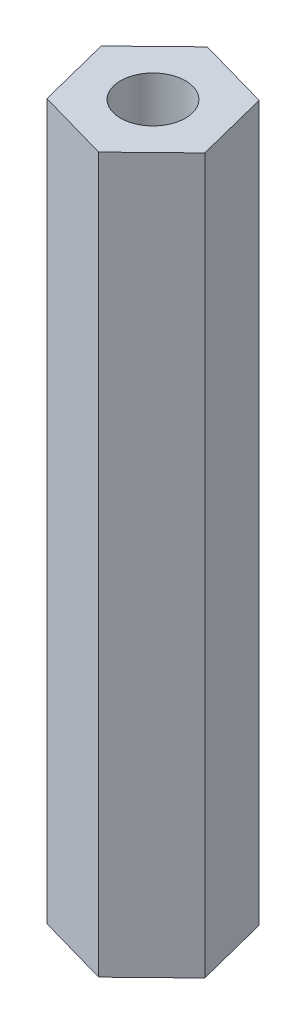
ISO-10303-21;
HEADER;
FILE_DESCRIPTION(('STEP AP214'),'2;1');
FILE_NAME('part.step','',(''),(''),'','','');
FILE_SCHEMA(('AUTOMOTIVE_DESIGN { 1 0 10303 214 1 1 1 1 }'));
ENDSEC;
DATA;
#1=APPLICATION_CONTEXT('core data for automotive mechanical design processes');
#2=APPLICATION_PROTOCOL_DEFINITION('international standard','automotive_design',2000,#1);
#3=PRODUCT_CONTEXT('',#1,'mechanical');
#4=PRODUCT('Part','Part','',(#3));
#5=PRODUCT_RELATED_PRODUCT_CATEGORY('part','',(#4));
#6=PRODUCT_DEFINITION_FORMATION('','',#4);
#7=PRODUCT_DEFINITION_CONTEXT('part definition',#1,'design');
#8=PRODUCT_DEFINITION('design','',#6,#7);
#9=PRODUCT_DEFINITION_SHAPE('','',#8);
#10=(LENGTH_UNIT() NAMED_UNIT(*) SI_UNIT(.MILLI.,.METRE.));
#11=(NAMED_UNIT(*) PLANE_ANGLE_UNIT() SI_UNIT($,.RADIAN.));
#12=(NAMED_UNIT(*) SI_UNIT($,.STERADIAN.) SOLID_ANGLE_UNIT());
#13=UNCERTAINTY_MEASURE_WITH_UNIT(LENGTH_MEASURE(1.E-05),#10,'distance_accuracy_value','');
#14=(GEOMETRIC_REPRESENTATION_CONTEXT(3) GLOBAL_UNCERTAINTY_ASSIGNED_CONTEXT((#13)) GLOBAL_UNIT_ASSIGNED_CONTEXT((#10,
#11,#12)) REPRESENTATION_CONTEXT('',''));
#15=CARTESIAN_POINT('',(0.,0.,0.));
#16=DIRECTION('',(0.,0.,1.));
#17=DIRECTION('',(1.,0.,0.));
#18=AXIS2_PLACEMENT_3D('',#15,#16,#17);
#19=CARTESIAN_POINT('',(0.,34.925,0.));
#20=DIRECTION('',(0.,1.,0.));
#21=DIRECTION('',(0.,0.,1.));
#22=AXIS2_PLACEMENT_3D('',#19,#20,#21);
#23=PLANE('',#22);
#24=DIRECTION('',(-0.245359671591106,0.,-0.969432118075683));
#25=VECTOR('',#24,1.);
#26=CARTESIAN_POINT('',(3.52771262489175,34.925,0.998036557202543));
#27=LINE('',#26,#25);
#28=CARTESIAN_POINT('',(3.52771262489175,34.925,0.998036557202543));
#29=VERTEX_POINT('',#28);
#30=CARTESIAN_POINT('',(2.62818132488884,34.925,-2.55607047180607));
#31=VERTEX_POINT('',#30);
#32=EDGE_CURVE('E129',#29,#31,#27,.T.);
#33=ORIENTED_EDGE('',*,*,#32,.T.);
#34=DIRECTION('',(-0.96223267729365,0.,-0.272228350375737));
#35=VECTOR('',#34,1.);
#36=CARTESIAN_POINT('',(2.62818132488884,34.925,-2.55607047180607));
#37=LINE('',#36,#35);
#38=CARTESIAN_POINT('',(-0.899531300002909,34.925,-3.55410702900861));
#39=VERTEX_POINT('',#38);
#40=EDGE_CURVE('E87',#31,#39,#37,.T.);
#41=ORIENTED_EDGE('',*,*,#40,.T.);
#42=DIRECTION('',(-0.716873005702543,0.,0.697203767699947));
#43=VECTOR('',#42,1.);
#44=CARTESIAN_POINT('',(-0.899531300002909,34.925,-3.55410702900861));
#45=LINE('',#44,#43);
#46=CARTESIAN_POINT('',(-3.52771262489175,34.925,-0.998036557202542));
#47=VERTEX_POINT('',#46);
#48=EDGE_CURVE('E100',#39,#47,#45,.T.);
#49=ORIENTED_EDGE('',*,*,#48,.T.);
#50=DIRECTION('',(0.245359671591106,0.,0.969432118075683));
#51=VECTOR('',#50,1.);
#52=CARTESIAN_POINT('',(-3.52771262489175,34.925,-0.998036557202542));
#53=LINE('',#52,#51);
#54=CARTESIAN_POINT('',(-2.62818132488884,34.925,2.55607047180607));
#55=VERTEX_POINT('',#54);
#56=EDGE_CURVE('E94',#47,#55,#53,.T.);
#57=ORIENTED_EDGE('',*,*,#56,.T.);
#58=DIRECTION('',(0.96223267729365,0.,0.272228350375737));
#59=VECTOR('',#58,1.);
#60=CARTESIAN_POINT('',(-2.62818132488884,34.925,2.55607047180607));
#61=LINE('',#60,#59);
#62=CARTESIAN_POINT('',(0.89953130000291,34.925,3.55410702900861));
#63=VERTEX_POINT('',#62);
#64=EDGE_CURVE('E98',#55,#63,#61,.T.);
#65=ORIENTED_EDGE('',*,*,#64,.T.);
#66=DIRECTION('',(0.716873005702544,0.,-0.697203767699946));
#67=VECTOR('',#66,1.);
#68=CARTESIAN_POINT('',(0.89953130000291,34.925,3.55410702900861));
#69=LINE('',#68,#67);
#70=EDGE_CURVE('E50',#63,#29,#69,.T.);
#71=ORIENTED_EDGE('',*,*,#70,.T.);
#72=EDGE_LOOP('',(#33,#41,#49,#57,#65,#71));
#73=FACE_BOUND('',#72,.T.);
#74=CARTESIAN_POINT('',(0.,34.925,0.));
#75=DIRECTION('',(0.,1.,0.));
#76=DIRECTION('',(0.,0.,1.));
#77=AXIS2_PLACEMENT_3D('',#74,#75,#76);
#78=CIRCLE('',#77,1.5875);
#79=CARTESIAN_POINT('',(0.,34.925,1.5875));
#80=VERTEX_POINT('',#79);
#81=EDGE_CURVE('E122',#80,#80,#78,.T.);
#82=ORIENTED_EDGE('',*,*,#81,.F.);
#83=EDGE_LOOP('',(#82));
#84=FACE_BOUND('',#83,.T.);
#85=ADVANCED_FACE('F33',(#73,#84),#23,.T.);
#86=CARTESIAN_POINT('',(0.,0.,0.));
#87=DIRECTION('',(0.,1.,0.));
#88=DIRECTION('',(0.,0.,1.));
#89=AXIS2_PLACEMENT_3D('',#86,#87,#88);
#90=PLANE('',#89);
#91=DIRECTION('',(-0.245359671591106,0.,-0.969432118075683));
#92=VECTOR('',#91,1.);
#93=CARTESIAN_POINT('',(3.52771262489175,0.,0.998036557202543));
#94=LINE('',#93,#92);
#95=CARTESIAN_POINT('',(3.52771262489175,0.,0.998036557202543));
#96=VERTEX_POINT('',#95);
#97=CARTESIAN_POINT('',(2.62818132488884,0.,-2.55607047180607));
#98=VERTEX_POINT('',#97);
#99=EDGE_CURVE('E118',#96,#98,#94,.T.);
#100=ORIENTED_EDGE('',*,*,#99,.F.);
#101=DIRECTION('',(0.716873005702544,0.,-0.697203767699946));
#102=VECTOR('',#101,1.);
#103=CARTESIAN_POINT('',(0.89953130000291,0.,3.55410702900861));
#104=LINE('',#103,#102);
#105=CARTESIAN_POINT('',(0.89953130000291,0.,3.55410702900861));
#106=VERTEX_POINT('',#105);
#107=EDGE_CURVE('E79',#106,#96,#104,.T.);
#108=ORIENTED_EDGE('',*,*,#107,.F.);
#109=DIRECTION('',(0.96223267729365,0.,0.272228350375737));
#110=VECTOR('',#109,1.);
#111=CARTESIAN_POINT('',(-2.62818132488884,0.,2.55607047180607));
#112=LINE('',#111,#110);
#113=CARTESIAN_POINT('',(-2.62818132488884,0.,2.55607047180607));
#114=VERTEX_POINT('',#113);
#115=EDGE_CURVE('E73',#114,#106,#112,.T.);
#116=ORIENTED_EDGE('',*,*,#115,.F.);
#117=DIRECTION('',(0.245359671591106,0.,0.969432118075683));
#118=VECTOR('',#117,1.);
#119=CARTESIAN_POINT('',(-3.52771262489175,0.,-0.998036557202542));
#120=LINE('',#119,#118);
#121=CARTESIAN_POINT('',(-3.52771262489175,0.,-0.998036557202542));
#122=VERTEX_POINT('',#121);
#123=EDGE_CURVE('E108',#122,#114,#120,.T.);
#124=ORIENTED_EDGE('',*,*,#123,.F.);
#125=DIRECTION('',(-0.716873005702543,0.,0.697203767699947));
#126=VECTOR('',#125,1.);
#127=CARTESIAN_POINT('',(-0.899531300002909,0.,-3.55410702900861));
#128=LINE('',#127,#126);
#129=CARTESIAN_POINT('',(-0.899531300002909,0.,-3.55410702900861));
#130=VERTEX_POINT('',#129);
#131=EDGE_CURVE('E124',#130,#122,#128,.T.);
#132=ORIENTED_EDGE('',*,*,#131,.F.);
#133=DIRECTION('',(-0.96223267729365,0.,-0.272228350375737));
#134=VECTOR('',#133,1.);
#135=CARTESIAN_POINT('',(2.62818132488884,0.,-2.55607047180607));
#136=LINE('',#135,#134);
#137=EDGE_CURVE('E121',#98,#130,#136,.T.);
#138=ORIENTED_EDGE('',*,*,#137,.F.);
#139=EDGE_LOOP('',(#100,#108,#116,#124,#132,#138));
#140=FACE_BOUND('',#139,.T.);
#141=CARTESIAN_POINT('',(0.,0.,0.));
#142=DIRECTION('',(0.,1.,0.));
#143=DIRECTION('',(0.,0.,1.));
#144=AXIS2_PLACEMENT_3D('',#141,#142,#143);
#145=CIRCLE('',#144,1.5875);
#146=CARTESIAN_POINT('',(0.,0.,1.5875));
#147=VERTEX_POINT('',#146);
#148=EDGE_CURVE('E222',#147,#147,#145,.T.);
#149=ORIENTED_EDGE('',*,*,#148,.T.);
#150=EDGE_LOOP('',(#149));
#151=FACE_BOUND('',#150,.T.);
#152=ADVANCED_FACE('F138',(#140,#151),#90,.F.);
#153=CARTESIAN_POINT('',(3.52771262489175,34.925,0.998036557202543));
#154=DIRECTION('',(-0.969432118075683,0.,0.245359671591106));
#155=DIRECTION('',(0.245359671591106,0.,0.969432118075683));
#156=AXIS2_PLACEMENT_3D('',#153,#154,#155);
#157=PLANE('',#156);
#158=ORIENTED_EDGE('',*,*,#99,.T.);
#159=DIRECTION('',(0.,-1.,0.));
#160=VECTOR('',#159,1.);
#161=CARTESIAN_POINT('',(2.62818132488884,34.925,-2.55607047180607));
#162=LINE('',#161,#160);
#163=EDGE_CURVE('E11',#31,#98,#162,.T.);
#164=ORIENTED_EDGE('',*,*,#163,.F.);
#165=ORIENTED_EDGE('',*,*,#32,.F.);
#166=DIRECTION('',(0.,-1.,0.));
#167=VECTOR('',#166,1.);
#168=CARTESIAN_POINT('',(3.52771262489175,34.925,0.998036557202543));
#169=LINE('',#168,#167);
#170=EDGE_CURVE('E114',#29,#96,#169,.T.);
#171=ORIENTED_EDGE('',*,*,#170,.T.);
#172=EDGE_LOOP('',(#158,#164,#165,#171));
#173=FACE_BOUND('',#172,.T.);
#174=ADVANCED_FACE('F35',(#173),#157,.F.);
#175=CARTESIAN_POINT('',(2.62818132488884,34.925,-2.55607047180607));
#176=DIRECTION('',(-0.272228350375737,0.,0.96223267729365));
#177=DIRECTION('',(0.96223267729365,0.,0.272228350375737));
#178=AXIS2_PLACEMENT_3D('',#175,#176,#177);
#179=PLANE('',#178);
#180=ORIENTED_EDGE('',*,*,#137,.T.);
#181=DIRECTION('',(0.,-1.,0.));
#182=VECTOR('',#181,1.);
#183=CARTESIAN_POINT('',(-0.899531300002909,34.925,-3.55410702900861));
#184=LINE('',#183,#182);
#185=EDGE_CURVE('E42',#39,#130,#184,.T.);
#186=ORIENTED_EDGE('',*,*,#185,.F.);
#187=ORIENTED_EDGE('',*,*,#40,.F.);
#188=ORIENTED_EDGE('',*,*,#163,.T.);
#189=EDGE_LOOP('',(#180,#186,#187,#188));
#190=FACE_BOUND('',#189,.T.);
#191=ADVANCED_FACE('F163',(#190),#179,.F.);
#192=CARTESIAN_POINT('',(-0.899531300002909,34.925,-3.55410702900861));
#193=DIRECTION('',(0.697203767699947,0.,0.716873005702544));
#194=DIRECTION('',(0.716873005702544,0.,-0.697203767699947));
#195=AXIS2_PLACEMENT_3D('',#192,#193,#194);
#196=PLANE('',#195);
#197=ORIENTED_EDGE('',*,*,#131,.T.);
#198=DIRECTION('',(0.,-1.,0.));
#199=VECTOR('',#198,1.);
#200=CARTESIAN_POINT('',(-3.52771262489175,34.925,-0.998036557202542));
#201=LINE('',#200,#199);
#202=EDGE_CURVE('E109',#47,#122,#201,.T.);
#203=ORIENTED_EDGE('',*,*,#202,.F.);
#204=ORIENTED_EDGE('',*,*,#48,.F.);
#205=ORIENTED_EDGE('',*,*,#185,.T.);
#206=EDGE_LOOP('',(#197,#203,#204,#205));
#207=FACE_BOUND('',#206,.T.);
#208=ADVANCED_FACE('F135',(#207),#196,.F.);
#209=CARTESIAN_POINT('',(-3.52771262489175,34.925,-0.998036557202542));
#210=DIRECTION('',(0.969432118075683,0.,-0.245359671591106));
#211=DIRECTION('',(-0.245359671591106,0.,-0.969432118075683));
#212=AXIS2_PLACEMENT_3D('',#209,#210,#211);
#213=PLANE('',#212);
#214=ORIENTED_EDGE('',*,*,#123,.T.);
#215=DIRECTION('',(0.,-1.,0.));
#216=VECTOR('',#215,1.);
#217=CARTESIAN_POINT('',(-2.62818132488884,34.925,2.55607047180607));
#218=LINE('',#217,#216);
#219=EDGE_CURVE('E105',#55,#114,#218,.T.);
#220=ORIENTED_EDGE('',*,*,#219,.F.);
#221=ORIENTED_EDGE('',*,*,#56,.F.);
#222=ORIENTED_EDGE('',*,*,#202,.T.);
#223=EDGE_LOOP('',(#214,#220,#221,#222));
#224=FACE_BOUND('',#223,.T.);
#225=ADVANCED_FACE('F106',(#224),#213,.F.);
#226=CARTESIAN_POINT('',(-2.62818132488884,34.925,2.55607047180607));
#227=DIRECTION('',(0.272228350375737,0.,-0.96223267729365));
#228=DIRECTION('',(-0.96223267729365,0.,-0.272228350375737));
#229=AXIS2_PLACEMENT_3D('',#226,#227,#228);
#230=PLANE('',#229);
#231=ORIENTED_EDGE('',*,*,#115,.T.);
#232=DIRECTION('',(0.,-1.,0.));
#233=VECTOR('',#232,1.);
#234=CARTESIAN_POINT('',(0.89953130000291,34.925,3.55410702900861));
#235=LINE('',#234,#233);
#236=EDGE_CURVE('E110',#63,#106,#235,.T.);
#237=ORIENTED_EDGE('',*,*,#236,.F.);
#238=ORIENTED_EDGE('',*,*,#64,.F.);
#239=ORIENTED_EDGE('',*,*,#219,.T.);
#240=EDGE_LOOP('',(#231,#237,#238,#239));
#241=FACE_BOUND('',#240,.T.);
#242=ADVANCED_FACE('F112',(#241),#230,.F.);
#243=CARTESIAN_POINT('',(0.89953130000291,34.925,3.55410702900861));
#244=DIRECTION('',(-0.697203767699946,0.,-0.716873005702544));
#245=DIRECTION('',(-0.716873005702544,0.,0.697203767699946));
#246=AXIS2_PLACEMENT_3D('',#243,#244,#245);
#247=PLANE('',#246);
#248=ORIENTED_EDGE('',*,*,#107,.T.);
#249=ORIENTED_EDGE('',*,*,#170,.F.);
#250=ORIENTED_EDGE('',*,*,#70,.F.);
#251=ORIENTED_EDGE('',*,*,#236,.T.);
#252=EDGE_LOOP('',(#248,#249,#250,#251));
#253=FACE_BOUND('',#252,.T.);
#254=ADVANCED_FACE('F143',(#253),#247,.F.);
#255=CARTESIAN_POINT('',(0.,34.925,0.));
#256=DIRECTION('',(0.,-1.,0.));
#257=DIRECTION('',(0.,0.,-1.));
#258=AXIS2_PLACEMENT_3D('',#255,#256,#257);
#259=CYLINDRICAL_SURFACE('',#258,1.5875);
#260=ORIENTED_EDGE('',*,*,#81,.T.);
#261=EDGE_LOOP('',(#260));
#262=FACE_BOUND('',#261,.T.);
#263=ORIENTED_EDGE('',*,*,#148,.F.);
#264=EDGE_LOOP('',(#263));
#265=FACE_BOUND('',#264,.T.);
#266=ADVANCED_FACE('F145',(#262,#265),#259,.F.);
#267=CLOSED_SHELL('',(#85,#152,#174,#191,#208,#225,#242,#254,#266));
#268=MANIFOLD_SOLID_BREP('B2',#267);
#269=ADVANCED_BREP_SHAPE_REPRESENTATION('',(#18,#268),#14);
#270=SHAPE_DEFINITION_REPRESENTATION(#9,#269);
ENDSEC;
END-ISO-10303-21;
